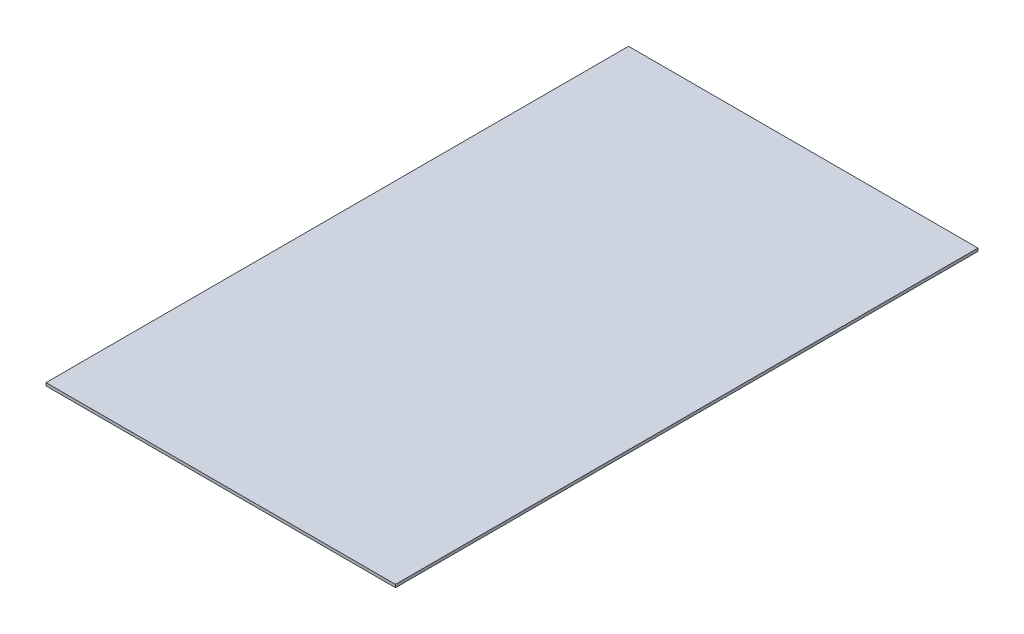
ISO-10303-21;
HEADER;
FILE_DESCRIPTION(('STEP AP214'),'2;1');
FILE_NAME('part.step','',(''),(''),'','','');
FILE_SCHEMA(('AUTOMOTIVE_DESIGN { 1 0 10303 214 1 1 1 1 }'));
ENDSEC;
DATA;
#1=APPLICATION_CONTEXT('core data for automotive mechanical design processes');
#2=APPLICATION_PROTOCOL_DEFINITION('international standard','automotive_design',2000,#1);
#3=PRODUCT_CONTEXT('',#1,'mechanical');
#4=PRODUCT('Part','Part','',(#3));
#5=PRODUCT_RELATED_PRODUCT_CATEGORY('part','',(#4));
#6=PRODUCT_DEFINITION_FORMATION('','',#4);
#7=PRODUCT_DEFINITION_CONTEXT('part definition',#1,'design');
#8=PRODUCT_DEFINITION('design','',#6,#7);
#9=PRODUCT_DEFINITION_SHAPE('','',#8);
#10=(LENGTH_UNIT() NAMED_UNIT(*) SI_UNIT(.MILLI.,.METRE.));
#11=(NAMED_UNIT(*) PLANE_ANGLE_UNIT() SI_UNIT($,.RADIAN.));
#12=(NAMED_UNIT(*) SI_UNIT($,.STERADIAN.) SOLID_ANGLE_UNIT());
#13=UNCERTAINTY_MEASURE_WITH_UNIT(LENGTH_MEASURE(1.E-05),#10,'distance_accuracy_value','');
#14=(GEOMETRIC_REPRESENTATION_CONTEXT(3) GLOBAL_UNCERTAINTY_ASSIGNED_CONTEXT((#13)) GLOBAL_UNIT_ASSIGNED_CONTEXT((#10,
#11,#12)) REPRESENTATION_CONTEXT('',''));
#15=CARTESIAN_POINT('',(0.,0.,0.));
#16=DIRECTION('',(0.,0.,1.));
#17=DIRECTION('',(1.,0.,0.));
#18=AXIS2_PLACEMENT_3D('',#15,#16,#17);
#19=CARTESIAN_POINT('',(60.,1.,100.));
#20=DIRECTION('',(-1.,0.,0.));
#21=DIRECTION('',(0.,0.,1.));
#22=AXIS2_PLACEMENT_3D('',#19,#20,#21);
#23=PLANE('',#22);
#24=DIRECTION('',(0.,0.,-1.));
#25=VECTOR('',#24,1.);
#26=CARTESIAN_POINT('',(60.,0.,100.));
#27=LINE('',#26,#25);
#28=CARTESIAN_POINT('',(60.,0.,100.));
#29=VERTEX_POINT('',#28);
#30=CARTESIAN_POINT('',(60.,0.,-100.));
#31=VERTEX_POINT('',#30);
#32=EDGE_CURVE('E96',#29,#31,#27,.T.);
#33=ORIENTED_EDGE('',*,*,#32,.T.);
#34=DIRECTION('',(0.,-1.,0.));
#35=VECTOR('',#34,1.);
#36=CARTESIAN_POINT('',(60.,1.,-100.));
#37=LINE('',#36,#35);
#38=CARTESIAN_POINT('',(60.,1.,-100.));
#39=VERTEX_POINT('',#38);
#40=EDGE_CURVE('E11',#39,#31,#37,.T.);
#41=ORIENTED_EDGE('',*,*,#40,.F.);
#42=DIRECTION('',(0.,0.,-1.));
#43=VECTOR('',#42,1.);
#44=CARTESIAN_POINT('',(60.,1.,100.));
#45=LINE('',#44,#43);
#46=CARTESIAN_POINT('',(60.,1.,100.));
#47=VERTEX_POINT('',#46);
#48=EDGE_CURVE('E84',#47,#39,#45,.T.);
#49=ORIENTED_EDGE('',*,*,#48,.F.);
#50=DIRECTION('',(0.,-1.,0.));
#51=VECTOR('',#50,1.);
#52=CARTESIAN_POINT('',(60.,1.,100.));
#53=LINE('',#52,#51);
#54=EDGE_CURVE('E92',#47,#29,#53,.T.);
#55=ORIENTED_EDGE('',*,*,#54,.T.);
#56=EDGE_LOOP('',(#33,#41,#49,#55));
#57=FACE_BOUND('',#56,.T.);
#58=ADVANCED_FACE('F33',(#57),#23,.F.);
#59=CARTESIAN_POINT('',(-60.,1.,-100.));
#60=DIRECTION('',(0.,0.,1.));
#61=DIRECTION('',(1.,0.,0.));
#62=AXIS2_PLACEMENT_3D('',#59,#60,#61);
#63=PLANE('',#62);
#64=DIRECTION('',(-1.,0.,0.));
#65=VECTOR('',#64,1.);
#66=CARTESIAN_POINT('',(-60.,0.,-100.));
#67=LINE('',#66,#65);
#68=CARTESIAN_POINT('',(-60.,0.,-100.));
#69=VERTEX_POINT('',#68);
#70=EDGE_CURVE('E88',#31,#69,#67,.T.);
#71=ORIENTED_EDGE('',*,*,#70,.T.);
#72=DIRECTION('',(0.,-1.,0.));
#73=VECTOR('',#72,1.);
#74=CARTESIAN_POINT('',(-60.,1.,-100.));
#75=LINE('',#74,#73);
#76=CARTESIAN_POINT('',(-60.,1.,-100.));
#77=VERTEX_POINT('',#76);
#78=EDGE_CURVE('E41',#77,#69,#75,.T.);
#79=ORIENTED_EDGE('',*,*,#78,.F.);
#80=DIRECTION('',(-1.,0.,0.));
#81=VECTOR('',#80,1.);
#82=CARTESIAN_POINT('',(-60.,1.,-100.));
#83=LINE('',#82,#81);
#84=EDGE_CURVE('E79',#39,#77,#83,.T.);
#85=ORIENTED_EDGE('',*,*,#84,.F.);
#86=ORIENTED_EDGE('',*,*,#40,.T.);
#87=EDGE_LOOP('',(#71,#79,#85,#86));
#88=FACE_BOUND('',#87,.T.);
#89=ADVANCED_FACE('F87',(#88),#63,.F.);
#90=CARTESIAN_POINT('',(-60.,1.,100.));
#91=DIRECTION('',(1.,0.,0.));
#92=DIRECTION('',(0.,0.,-1.));
#93=AXIS2_PLACEMENT_3D('',#90,#91,#92);
#94=PLANE('',#93);
#95=DIRECTION('',(0.,0.,1.));
#96=VECTOR('',#95,1.);
#97=CARTESIAN_POINT('',(-60.,0.,100.));
#98=LINE('',#97,#96);
#99=CARTESIAN_POINT('',(-60.,0.,100.));
#100=VERTEX_POINT('',#99);
#101=EDGE_CURVE('E66',#69,#100,#98,.T.);
#102=ORIENTED_EDGE('',*,*,#101,.T.);
#103=DIRECTION('',(0.,-1.,0.));
#104=VECTOR('',#103,1.);
#105=CARTESIAN_POINT('',(-60.,1.,100.));
#106=LINE('',#105,#104);
#107=CARTESIAN_POINT('',(-60.,1.,100.));
#108=VERTEX_POINT('',#107);
#109=EDGE_CURVE('E89',#108,#100,#106,.T.);
#110=ORIENTED_EDGE('',*,*,#109,.F.);
#111=DIRECTION('',(0.,0.,1.));
#112=VECTOR('',#111,1.);
#113=CARTESIAN_POINT('',(-60.,1.,100.));
#114=LINE('',#113,#112);
#115=EDGE_CURVE('E82',#77,#108,#114,.T.);
#116=ORIENTED_EDGE('',*,*,#115,.F.);
#117=ORIENTED_EDGE('',*,*,#78,.T.);
#118=EDGE_LOOP('',(#102,#110,#116,#117));
#119=FACE_BOUND('',#118,.T.);
#120=ADVANCED_FACE('F90',(#119),#94,.F.);
#121=CARTESIAN_POINT('',(-60.,1.,100.));
#122=DIRECTION('',(0.,0.,-1.));
#123=DIRECTION('',(-1.,0.,0.));
#124=AXIS2_PLACEMENT_3D('',#121,#122,#123);
#125=PLANE('',#124);
#126=DIRECTION('',(1.,0.,0.));
#127=VECTOR('',#126,1.);
#128=CARTESIAN_POINT('',(-60.,0.,100.));
#129=LINE('',#128,#127);
#130=EDGE_CURVE('E72',#100,#29,#129,.T.);
#131=ORIENTED_EDGE('',*,*,#130,.T.);
#132=ORIENTED_EDGE('',*,*,#54,.F.);
#133=DIRECTION('',(1.,0.,0.));
#134=VECTOR('',#133,1.);
#135=CARTESIAN_POINT('',(-60.,1.,100.));
#136=LINE('',#135,#134);
#137=EDGE_CURVE('E49',#108,#47,#136,.T.);
#138=ORIENTED_EDGE('',*,*,#137,.F.);
#139=ORIENTED_EDGE('',*,*,#109,.T.);
#140=EDGE_LOOP('',(#131,#132,#138,#139));
#141=FACE_BOUND('',#140,.T.);
#142=ADVANCED_FACE('F103',(#141),#125,.F.);
#143=CARTESIAN_POINT('',(0.,1.,0.));
#144=DIRECTION('',(0.,-1.,0.));
#145=DIRECTION('',(0.,0.,-1.));
#146=AXIS2_PLACEMENT_3D('',#143,#144,#145);
#147=PLANE('',#146);
#148=ORIENTED_EDGE('',*,*,#48,.T.);
#149=ORIENTED_EDGE('',*,*,#84,.T.);
#150=ORIENTED_EDGE('',*,*,#115,.T.);
#151=ORIENTED_EDGE('',*,*,#137,.T.);
#152=EDGE_LOOP('',(#148,#149,#150,#151));
#153=FACE_BOUND('',#152,.T.);
#154=ADVANCED_FACE('F80',(#153),#147,.F.);
#155=CARTESIAN_POINT('',(0.,0.,0.));
#156=DIRECTION('',(0.,-1.,0.));
#157=DIRECTION('',(0.,0.,-1.));
#158=AXIS2_PLACEMENT_3D('',#155,#156,#157);
#159=PLANE('',#158);
#160=ORIENTED_EDGE('',*,*,#32,.F.);
#161=ORIENTED_EDGE('',*,*,#130,.F.);
#162=ORIENTED_EDGE('',*,*,#101,.F.);
#163=ORIENTED_EDGE('',*,*,#70,.F.);
#164=EDGE_LOOP('',(#160,#161,#162,#163));
#165=FACE_BOUND('',#164,.T.);
#166=ADVANCED_FACE('F106',(#165),#159,.T.);
#167=CLOSED_SHELL('',(#58,#89,#120,#142,#154,#166));
#168=MANIFOLD_SOLID_BREP('B2',#167);
#169=ADVANCED_BREP_SHAPE_REPRESENTATION('',(#18,#168),#14);
#170=SHAPE_DEFINITION_REPRESENTATION(#9,#169);
ENDSEC;
END-ISO-10303-21;
